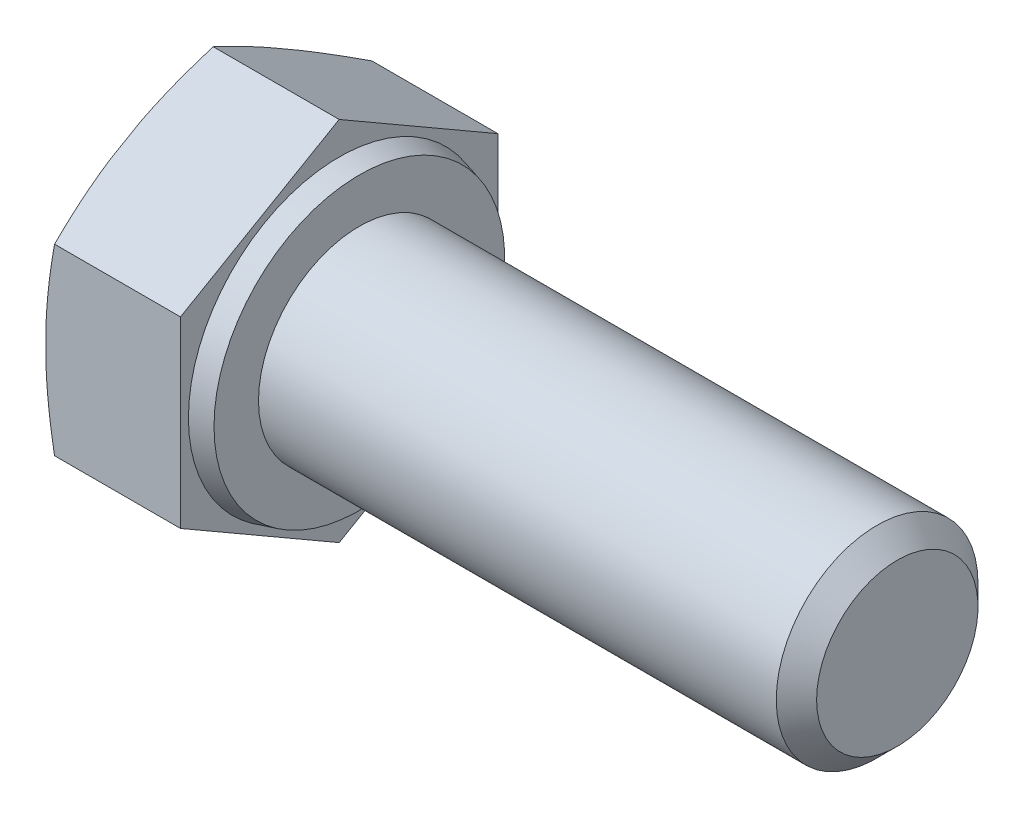
ISO-10303-21;
HEADER;
FILE_DESCRIPTION(('STEP AP214'),'2;1');
FILE_NAME('part.step','',(''),(''),'','','');
FILE_SCHEMA(('AUTOMOTIVE_DESIGN { 1 0 10303 214 1 1 1 1 }'));
ENDSEC;
DATA;
#1=APPLICATION_CONTEXT('core data for automotive mechanical design processes');
#2=APPLICATION_PROTOCOL_DEFINITION('international standard','automotive_design',2000,#1);
#3=PRODUCT_CONTEXT('',#1,'mechanical');
#4=PRODUCT('Part','Part','',(#3));
#5=PRODUCT_RELATED_PRODUCT_CATEGORY('part','',(#4));
#6=PRODUCT_DEFINITION_FORMATION('','',#4);
#7=PRODUCT_DEFINITION_CONTEXT('part definition',#1,'design');
#8=PRODUCT_DEFINITION('design','',#6,#7);
#9=PRODUCT_DEFINITION_SHAPE('','',#8);
#10=(LENGTH_UNIT() NAMED_UNIT(*) SI_UNIT(.MILLI.,.METRE.));
#11=(NAMED_UNIT(*) PLANE_ANGLE_UNIT() SI_UNIT($,.RADIAN.));
#12=(NAMED_UNIT(*) SI_UNIT($,.STERADIAN.) SOLID_ANGLE_UNIT());
#13=UNCERTAINTY_MEASURE_WITH_UNIT(LENGTH_MEASURE(1.E-05),#10,'distance_accuracy_value','');
#14=(GEOMETRIC_REPRESENTATION_CONTEXT(3) GLOBAL_UNCERTAINTY_ASSIGNED_CONTEXT((#13)) GLOBAL_UNIT_ASSIGNED_CONTEXT((#10,
#11,#12)) REPRESENTATION_CONTEXT('',''));
#15=CARTESIAN_POINT('',(0.,0.,0.));
#16=DIRECTION('',(0.,0.,1.));
#17=DIRECTION('',(1.,0.,0.));
#18=AXIS2_PLACEMENT_3D('',#15,#16,#17);
#19=CARTESIAN_POINT('',(16.5999999999999,-2.725,-4.71983845062519));
#20=DIRECTION('',(0.,-0.866025403784439,-0.5));
#21=DIRECTION('',(0.,0.5,-0.866025403784439));
#22=AXIS2_PLACEMENT_3D('',#19,#20,#21);
#23=PLANE('',#22);
#24=DIRECTION('',(-1.,0.,0.));
#25=VECTOR('',#24,1.);
#26=CARTESIAN_POINT('',(16.5999999999999,-5.45,0.));
#27=LINE('',#26,#25);
#28=CARTESIAN_POINT('',(0.,-5.45,0.));
#29=VERTEX_POINT('',#28);
#30=CARTESIAN_POINT('',(-3.7452208360137,-5.45,0.));
#31=VERTEX_POINT('',#30);
#32=EDGE_CURVE('E158',#29,#31,#27,.T.);
#33=ORIENTED_EDGE('',*,*,#32,.T.);
#34=CARTESIAN_POINT('',(-2.80359670741345,-7.34011268981057,3.27377121078258));
#35=CARTESIAN_POINT('',(-2.84436934173908,-7.27090787880275,3.15390496198883));
#36=CARTESIAN_POINT('',(-2.88473403740724,-7.2016429998134,3.03393467239918));
#37=CARTESIAN_POINT('',(-2.96451817766387,-7.06297557149015,2.79375564118839));
#38=CARTESIAN_POINT('',(-3.00393759976687,-6.9935730189238,2.6735468939685));
#39=CARTESIAN_POINT('',(-3.12060727053392,-6.78509054777123,2.31244466144474));
#40=CARTESIAN_POINT('',(-3.19624120176492,-6.64578254822507,2.07115612833001));
#41=CARTESIAN_POINT('',(-3.34254144823286,-6.36498483296062,1.58480021884271));
#42=CARTESIAN_POINT('',(-3.41314888153984,-6.22348739251692,1.33971946285328));
#43=CARTESIAN_POINT('',(-3.54653963124449,-5.93956996950973,0.847960061050806));
#44=CARTESIAN_POINT('',(-3.60932336119064,-5.79715003612673,0.601281500420866));
#45=CARTESIAN_POINT('',(-3.72240408986714,-5.51627771537165,0.114796370433285));
#46=CARTESIAN_POINT('',(-3.77306309614606,-5.37786233449134,-0.124946101800416));
#47=CARTESIAN_POINT('',(-3.86174791509955,-5.10000705673909,-0.606205560018476));
#48=CARTESIAN_POINT('',(-3.89977434383025,-4.9605672101666,-0.847722458881628));
#49=CARTESIAN_POINT('',(-3.96002895002584,-4.68152439808752,-1.33103878688949));
#50=CARTESIAN_POINT('',(-3.98233595362987,-4.54192581389901,-1.57283062736867));
#51=CARTESIAN_POINT('',(-4.00922217993067,-4.26230405370948,-2.05714972291879));
#52=CARTESIAN_POINT('',(-4.01380367654362,-4.12228093447653,-2.29967687966451));
#53=CARTESIAN_POINT('',(-4.00501625874682,-3.8508494021201,-2.76981008448214));
#54=CARTESIAN_POINT('',(-3.99271543484409,-3.71943177378256,-2.99743209377296));
#55=CARTESIAN_POINT('',(-3.95321166906913,-3.45715843275631,-3.45170284590126));
#56=CARTESIAN_POINT('',(-3.92600704652764,-3.32630278511853,-3.67835147606722));
#57=CARTESIAN_POINT('',(-3.85873771892874,-3.06480848650408,-4.13127288715704));
#58=CARTESIAN_POINT('',(-3.81861253999202,-2.93417381895763,-4.35753876857736));
#59=CARTESIAN_POINT('',(-3.72806412050347,-2.67381544243305,-4.80849270489409));
#60=CARTESIAN_POINT('',(-3.67764082013554,-2.54409173875073,-5.03318075061788));
#61=CARTESIAN_POINT('',(-3.56690934471619,-2.28103368100204,-5.48881067197899));
#62=CARTESIAN_POINT('',(-3.5063200098959,-2.14772928655015,-5.71970065604188));
#63=CARTESIAN_POINT('',(-3.37862490619735,-1.88190401874505,-6.18012352581591));
#64=CARTESIAN_POINT('',(-3.31151881066873,-1.74938318502113,-6.40965634288713));
#65=CARTESIAN_POINT('',(-3.17300072750933,-1.48622105229928,-6.86546652738956));
#66=CARTESIAN_POINT('',(-3.10163437183036,-1.35557371269241,-7.09175435746236));
#67=CARTESIAN_POINT('',(-2.99179561017672,-1.16001599812026,-7.43047025491337));
#68=CARTESIAN_POINT('',(-2.95472291342734,-1.09490757242993,-7.54324135620985));
#69=CARTESIAN_POINT('',(-2.87975227112319,-0.964810882473038,-7.76857543311172));
#70=CARTESIAN_POINT('',(-2.8418543411671,-0.899822615960361,-7.8811384126075));
#71=CARTESIAN_POINT('',(-2.80359670741345,-0.834887310189432,-7.99360966140777));
#72=B_SPLINE_CURVE_WITH_KNOTS('',3,(#34,#35,#36,#37,#38,#39,#40,#41,#42,#43,#44,#45,#46,#47,#48,
#49,#50,#51,#52,#53,#54,#55,#56,#57,#58,#59,#60,#61,#62,#63,#64,#65,#66,#67,#68,#69,#70,#71),
.UNSPECIFIED.,.F.,.F.,(4,2,2,2,2,2,2,2,2,2,2,2,2,2,2,2,2,2,4),(0.,0.432869091724628,
0.86574847002923,1.73179966816006,2.60673022630927,3.48161451738991,4.32567400721243,
5.16969232852602,6.00944755025397,6.84909504043365,7.6379988773398,8.42699169555014,
9.2197323731281,10.0124776554303,10.8325909601046,11.6527453939116,12.4653044284207,
12.871476359479,13.2776406196665),.UNSPECIFIED.);
#73=CARTESIAN_POINT('',(-4.,-4.35471947908043,-1.89708151077319));
#74=VERTEX_POINT('',#73);
#75=EDGE_CURVE('E203',#31,#74,#72,.T.);
#76=ORIENTED_EDGE('',*,*,#75,.T.);
#77=DIRECTION('',(0.,-0.5,0.866025403784439));
#78=VECTOR('',#77,1.);
#79=CARTESIAN_POINT('',(-4.,-2.725,-4.71983845062519));
#80=LINE('',#79,#78);
#81=CARTESIAN_POINT('',(-4.,-3.82028052091957,-2.822756939852));
#82=VERTEX_POINT('',#81);
#83=EDGE_CURVE('E213',#82,#74,#80,.T.);
#84=ORIENTED_EDGE('',*,*,#83,.F.);
#85=CARTESIAN_POINT('',(-3.7452208360137,-2.725,-4.71983845062519));
#86=VERTEX_POINT('',#85);
#87=EDGE_CURVE('E216',#82,#86,#72,.T.);
#88=ORIENTED_EDGE('',*,*,#87,.T.);
#89=DIRECTION('',(-1.,0.,0.));
#90=VECTOR('',#89,1.);
#91=CARTESIAN_POINT('',(16.5999999999999,-2.725,-4.71983845062519));
#92=LINE('',#91,#90);
#93=CARTESIAN_POINT('',(0.,-2.725,-4.71983845062519));
#94=VERTEX_POINT('',#93);
#95=EDGE_CURVE('E169',#94,#86,#92,.T.);
#96=ORIENTED_EDGE('',*,*,#95,.F.);
#97=DIRECTION('',(0.,-0.5,0.866025403784439));
#98=VECTOR('',#97,1.);
#99=CARTESIAN_POINT('',(0.,-2.725,-4.71983845062519));
#100=LINE('',#99,#98);
#101=EDGE_CURVE('E184',#94,#29,#100,.T.);
#102=ORIENTED_EDGE('',*,*,#101,.T.);
#103=EDGE_LOOP('',(#33,#76,#84,#88,#96,#102));
#104=FACE_BOUND('',#103,.T.);
#105=ADVANCED_FACE('F36',(#104),#23,.T.);
#106=CARTESIAN_POINT('',(16.5999999999999,2.725,-4.71983845062519));
#107=DIRECTION('',(0.,0.,-1.));
#108=DIRECTION('',(-1.,0.,0.));
#109=AXIS2_PLACEMENT_3D('',#106,#107,#108);
#110=PLANE('',#109);
#111=ORIENTED_EDGE('',*,*,#95,.T.);
#112=CARTESIAN_POINT('',(-2.9506871174777,-5.99877121078259,-4.71983845062519));
#113=CARTESIAN_POINT('',(-2.98850568066813,-5.86655061994932,-4.71983845062519));
#114=CARTESIAN_POINT('',(-3.02588733348672,-5.73420510572345,-4.71983845062519));
#115=CARTESIAN_POINT('',(-3.09964137777749,-5.46923092543767,-4.71983845062519));
#116=CARTESIAN_POINT('',(-3.13601375217484,-5.3366022546282,-4.71983845062519));
#117=CARTESIAN_POINT('',(-3.24344066732154,-4.93814152280156,-4.71983845062519));
#118=CARTESIAN_POINT('',(-3.31277438033119,-4.67184097821475,-4.71983845062519));
#119=CARTESIAN_POINT('',(-3.44598984723749,-4.13540056856217,-4.71983845062519));
#120=CARTESIAN_POINT('',(-3.50981875867931,-3.86524747724054,-4.71983845062519));
#121=CARTESIAN_POINT('',(-3.62935640937805,-3.3231474614196,-4.71983845062519));
#122=CARTESIAN_POINT('',(-3.68506574564966,-3.05120067034556,-4.71983845062519));
#123=CARTESIAN_POINT('',(-3.7842051067148,-2.51422588041989,-4.71983845062519));
#124=CARTESIAN_POINT('',(-3.82797675451138,-2.24926199844372,-4.71983845062519));
#125=CARTESIAN_POINT('',(-3.90294006806177,-1.71757094380412,-4.71983845062519));
#126=CARTESIAN_POINT('',(-3.93413417057669,-1.45084412287816,-4.71983845062519));
#127=CARTESIAN_POINT('',(-3.98136829922155,-0.917139045763637,-4.71983845062519));
#128=CARTESIAN_POINT('',(-3.99747120183632,-0.650166513848194,-4.71983845062519));
#129=CARTESIAN_POINT('',(-4.01319405607081,-0.115738248934143,-4.71983845062519));
#130=CARTESIAN_POINT('',(-4.01281531208384,0.151717444150779,-4.71983845062519));
#131=CARTESIAN_POINT('',(-3.99672210978996,0.652273398606605,-4.71983845062519));
#132=CARTESIAN_POINT('',(-3.98295365350144,0.885439786641174,-4.71983845062519));
#133=CARTESIAN_POINT('',(-3.9439102240837,1.35079228411295,-4.71983845062519));
#134=CARTESIAN_POINT('',(-3.91863474313828,1.58297834983112,-4.71983845062519));
#135=CARTESIAN_POINT('',(-3.8277233558607,2.27921679772146,-4.71983845062519));
#136=CARTESIAN_POINT('',(-3.74707511602764,2.74130964784515,-4.71983845062519));
#137=CARTESIAN_POINT('',(-3.60495532267596,3.43699496327634,-4.71983845062519));
#138=CARTESIAN_POINT('',(-3.55315057241573,3.67272543522797,-4.71983845062519));
#139=CARTESIAN_POINT('',(-3.44400801927864,4.14293122164741,-4.71983845062519));
#140=CARTESIAN_POINT('',(-3.38666994202673,4.37740647326489,-4.71983845062519));
#141=CARTESIAN_POINT('',(-3.26810191427154,4.84357463704433,-4.71983845062519));
#142=CARTESIAN_POINT('',(-3.20690265666811,5.07527546383244,-4.71983845062519));
#143=CARTESIAN_POINT('',(-3.08112090052241,5.53769892040991,-4.71983845062519));
#144=CARTESIAN_POINT('',(-3.01653922498027,5.76842177352407,-4.71983845062519));
#145=CARTESIAN_POINT('',(-2.95068711747769,5.99877121078259,-4.71983845062519));
#146=B_SPLINE_CURVE_WITH_KNOTS('',3,(#112,#113,#114,#115,#116,#117,#118,#119,#120,#121,#122,
#123,#124,#125,#126,#127,#128,#129,#130,#131,#132,#133,#134,#135,#136,#137,#138,#139,#140,#141,
#142,#143,#144,#145),.UNSPECIFIED.,.F.,.F.,(4,2,2,2,2,2,2,2,2,2,2,2,2,2,2,2,4),(0.,
0.41256707072817,0.825141116959283,1.65062085257202,2.48330240810143,3.31592270744702,
4.12134919611599,4.92661956719314,5.72851971870752,6.53035640621696,7.23076213486735,
7.93119877610125,9.33697768486694,10.0610249139554,10.7851080640487,11.5040240500474,
12.222765916872),.UNSPECIFIED.);
#147=CARTESIAN_POINT('',(-4.,-0.534438958160884,-4.71983845062518));
#148=VERTEX_POINT('',#147);
#149=EDGE_CURVE('E224',#86,#148,#146,.T.);
#150=ORIENTED_EDGE('',*,*,#149,.T.);
#151=DIRECTION('',(0.,-1.,0.));
#152=VECTOR('',#151,1.);
#153=CARTESIAN_POINT('',(-4.,2.725,-4.71983845062519));
#154=LINE('',#153,#152);
#155=CARTESIAN_POINT('',(-4.,0.534438958160885,-4.71983845062519));
#156=VERTEX_POINT('',#155);
#157=EDGE_CURVE('E164',#156,#148,#154,.T.);
#158=ORIENTED_EDGE('',*,*,#157,.F.);
#159=CARTESIAN_POINT('',(-3.7452208360137,2.725,-4.71983845062519));
#160=VERTEX_POINT('',#159);
#161=EDGE_CURVE('E51',#156,#160,#146,.T.);
#162=ORIENTED_EDGE('',*,*,#161,.T.);
#163=DIRECTION('',(-1.,0.,0.));
#164=VECTOR('',#163,1.);
#165=CARTESIAN_POINT('',(16.5999999999999,2.725,-4.71983845062519));
#166=LINE('',#165,#164);
#167=CARTESIAN_POINT('',(0.,2.725,-4.71983845062519));
#168=VERTEX_POINT('',#167);
#169=EDGE_CURVE('E155',#168,#160,#166,.T.);
#170=ORIENTED_EDGE('',*,*,#169,.F.);
#171=DIRECTION('',(0.,-1.,0.));
#172=VECTOR('',#171,1.);
#173=CARTESIAN_POINT('',(0.,5.45,-4.71983845062519));
#174=LINE('',#173,#172);
#175=EDGE_CURVE('E182',#168,#94,#174,.T.);
#176=ORIENTED_EDGE('',*,*,#175,.T.);
#177=EDGE_LOOP('',(#111,#150,#158,#162,#170,#176));
#178=FACE_BOUND('',#177,.T.);
#179=ADVANCED_FACE('F251',(#178),#110,.T.);
#180=CARTESIAN_POINT('',(16.5999999999999,5.45,0.));
#181=DIRECTION('',(0.,0.866025403784439,-0.5));
#182=DIRECTION('',(0.,0.5,0.866025403784439));
#183=AXIS2_PLACEMENT_3D('',#180,#181,#182);
#184=PLANE('',#183);
#185=ORIENTED_EDGE('',*,*,#169,.T.);
#186=CARTESIAN_POINT('',(-2.80359670741345,0.834887310189431,-7.99360966140777));
#187=CARTESIAN_POINT('',(-2.84436934173908,0.904092121197253,-7.87374341261402));
#188=CARTESIAN_POINT('',(-2.88473403740724,0.973357000186598,-7.75377312302437));
#189=CARTESIAN_POINT('',(-2.96451817766387,1.11202442850985,-7.51359409181358));
#190=CARTESIAN_POINT('',(-3.00393759976687,1.1814269810762,-7.3933853445937));
#191=CARTESIAN_POINT('',(-3.12060727053392,1.38990945222877,-7.03228311206994));
#192=CARTESIAN_POINT('',(-3.19624120176492,1.52921745177493,-6.7909945789552));
#193=CARTESIAN_POINT('',(-3.34254144823286,1.81001516703938,-6.3046386694679));
#194=CARTESIAN_POINT('',(-3.41314888153984,1.95151260748308,-6.05955791347847));
#195=CARTESIAN_POINT('',(-3.54653963124449,2.23543003049027,-5.567798511676));
#196=CARTESIAN_POINT('',(-3.60932336119064,2.37784996387327,-5.32111995104606));
#197=CARTESIAN_POINT('',(-3.72240408986713,2.65872228462835,-4.83463482105848));
#198=CARTESIAN_POINT('',(-3.77306309614606,2.79713766550867,-4.59489234882478));
#199=CARTESIAN_POINT('',(-3.86174791509955,3.07499294326092,-4.11363289060672));
#200=CARTESIAN_POINT('',(-3.89977434383025,3.2144327898334,-3.87211599174356));
#201=CARTESIAN_POINT('',(-3.96002895002584,3.49347560191248,-3.3887996637357));
#202=CARTESIAN_POINT('',(-3.98233595362987,3.63307418610099,-3.14700782325652));
#203=CARTESIAN_POINT('',(-4.00922217993067,3.91269594629053,-2.66268872770641));
#204=CARTESIAN_POINT('',(-4.01380367654362,4.05271906552347,-2.42016157096068));
#205=CARTESIAN_POINT('',(-4.00501625874682,4.3241505978799,-1.95002836614305));
#206=CARTESIAN_POINT('',(-3.99271543484409,4.45556822621744,-1.72240635685223));
#207=CARTESIAN_POINT('',(-3.95321166906913,4.71784156724369,-1.26813560472393));
#208=CARTESIAN_POINT('',(-3.92600704652764,4.84869721488147,-1.04148697455797));
#209=CARTESIAN_POINT('',(-3.85873771892874,5.11019151349592,-0.588565563468155));
#210=CARTESIAN_POINT('',(-3.81861253999202,5.24082618104237,-0.36229968204783));
#211=CARTESIAN_POINT('',(-3.72806412050348,5.50118455756696,0.0886542542689005));
#212=CARTESIAN_POINT('',(-3.67764082013554,5.63090826124928,0.313342299992688));
#213=CARTESIAN_POINT('',(-3.56690934471619,5.89396631899796,0.768972221353798));
#214=CARTESIAN_POINT('',(-3.5063200098959,6.02727071344986,0.999862205416685));
#215=CARTESIAN_POINT('',(-3.37862490619735,6.29309598125496,1.46028507519072));
#216=CARTESIAN_POINT('',(-3.31151881066873,6.42561681497888,1.68981789226193));
#217=CARTESIAN_POINT('',(-3.17300072750933,6.68877894770073,2.14562807676437));
#218=CARTESIAN_POINT('',(-3.10163437183036,6.81942628730759,2.37191590683717));
#219=CARTESIAN_POINT('',(-2.99179561017672,7.01498400187974,2.71063180428818));
#220=CARTESIAN_POINT('',(-2.95472291342734,7.08009242757007,2.82340290558466));
#221=CARTESIAN_POINT('',(-2.87975227112319,7.21018911752696,3.04873698248653));
#222=CARTESIAN_POINT('',(-2.8418543411671,7.27517738403964,3.16129996198231));
#223=CARTESIAN_POINT('',(-2.80359670741345,7.34011268981057,3.27377121078258));
#224=B_SPLINE_CURVE_WITH_KNOTS('',3,(#186,#187,#188,#189,#190,#191,#192,#193,#194,#195,#196,
#197,#198,#199,#200,#201,#202,#203,#204,#205,#206,#207,#208,#209,#210,#211,#212,#213,#214,#215,
#216,#217,#218,#219,#220,#221,#222,#223),.UNSPECIFIED.,.F.,.F.,(4,2,2,2,2,2,2,2,2,2,2,2,2,2,2,2,
2,2,4),(0.,0.432869091724627,0.865748470029229,1.73179966816006,2.60673022630927,
3.48161451738991,4.32567400721243,5.16969232852602,6.00944755025397,6.84909504043365,
7.6379988773398,8.42699169555014,9.21973237312809,10.0124776554303,10.8325909601046,
11.6527453939116,12.4653044284207,12.871476359479,13.2776406196665),.UNSPECIFIED.);
#225=CARTESIAN_POINT('',(-4.,3.82028052091956,-2.82275693985199));
#226=VERTEX_POINT('',#225);
#227=EDGE_CURVE('E246',#160,#226,#224,.T.);
#228=ORIENTED_EDGE('',*,*,#227,.T.);
#229=DIRECTION('',(0.,-0.5,-0.866025403784439));
#230=VECTOR('',#229,1.);
#231=CARTESIAN_POINT('',(-4.,5.45,0.));
#232=LINE('',#231,#230);
#233=CARTESIAN_POINT('',(-4.,4.35471947908044,-1.89708151077319));
#234=VERTEX_POINT('',#233);
#235=EDGE_CURVE('E236',#234,#226,#232,.T.);
#236=ORIENTED_EDGE('',*,*,#235,.F.);
#237=CARTESIAN_POINT('',(-3.7452208360137,5.45,0.));
#238=VERTEX_POINT('',#237);
#239=EDGE_CURVE('E59',#234,#238,#224,.T.);
#240=ORIENTED_EDGE('',*,*,#239,.T.);
#241=DIRECTION('',(-1.,0.,0.));
#242=VECTOR('',#241,1.);
#243=CARTESIAN_POINT('',(16.5999999999999,5.45,0.));
#244=LINE('',#243,#242);
#245=CARTESIAN_POINT('',(0.,5.45,0.));
#246=VERTEX_POINT('',#245);
#247=EDGE_CURVE('E152',#246,#238,#244,.T.);
#248=ORIENTED_EDGE('',*,*,#247,.F.);
#249=DIRECTION('',(0.,-0.5,-0.866025403784439));
#250=VECTOR('',#249,1.);
#251=CARTESIAN_POINT('',(0.,5.45,0.));
#252=LINE('',#251,#250);
#253=EDGE_CURVE('E180',#246,#168,#252,.T.);
#254=ORIENTED_EDGE('',*,*,#253,.T.);
#255=EDGE_LOOP('',(#185,#228,#236,#240,#248,#254));
#256=FACE_BOUND('',#255,.T.);
#257=ADVANCED_FACE('F244',(#256),#184,.T.);
#258=CARTESIAN_POINT('',(16.5999999999999,2.725,4.71983845062519));
#259=DIRECTION('',(0.,0.866025403784439,0.5));
#260=DIRECTION('',(0.,-0.5,0.866025403784439));
#261=AXIS2_PLACEMENT_3D('',#258,#259,#260);
#262=PLANE('',#261);
#263=ORIENTED_EDGE('',*,*,#247,.T.);
#264=CARTESIAN_POINT('',(-2.80359670741345,7.34011268981057,-3.27377121078259));
#265=CARTESIAN_POINT('',(-2.84436934173908,7.27090787880275,-3.15390496198884));
#266=CARTESIAN_POINT('',(-2.88473403740724,7.20164299981341,-3.03393467239918));
#267=CARTESIAN_POINT('',(-2.96451817766387,7.06297557149016,-2.7937556411884));
#268=CARTESIAN_POINT('',(-3.00393759976687,6.99357301892381,-2.67354689396851));
#269=CARTESIAN_POINT('',(-3.12060727053392,6.78509054777124,-2.31244466144475));
#270=CARTESIAN_POINT('',(-3.19624120176492,6.64578254822508,-2.07115612833002));
#271=CARTESIAN_POINT('',(-3.34254144823286,6.36498483296062,-1.58480021884272));
#272=CARTESIAN_POINT('',(-3.41314888153984,6.22348739251693,-1.33971946285329));
#273=CARTESIAN_POINT('',(-3.54653963124449,5.93956996950974,-0.847960061050813));
#274=CARTESIAN_POINT('',(-3.60932336119064,5.79715003612673,-0.601281500420872));
#275=CARTESIAN_POINT('',(-3.72240408986713,5.51627771537165,-0.114796370433292));
#276=CARTESIAN_POINT('',(-3.77306309614606,5.37786233449134,0.124946101800409));
#277=CARTESIAN_POINT('',(-3.86174791509955,5.10000705673909,0.60620556001847));
#278=CARTESIAN_POINT('',(-3.89977434383025,4.9605672101666,0.847722458881622));
#279=CARTESIAN_POINT('',(-3.96002895002584,4.68152439808752,1.33103878688948));
#280=CARTESIAN_POINT('',(-3.98233595362987,4.54192581389901,1.57283062736866));
#281=CARTESIAN_POINT('',(-4.00922217993067,4.26230405370948,2.05714972291878));
#282=CARTESIAN_POINT('',(-4.01380367654362,4.12228093447654,2.29967687966451));
#283=CARTESIAN_POINT('',(-4.00501625874682,3.8508494021201,2.76981008448214));
#284=CARTESIAN_POINT('',(-3.99271543484409,3.71943177378256,2.99743209377295));
#285=CARTESIAN_POINT('',(-3.95321166906913,3.45715843275631,3.45170284590126));
#286=CARTESIAN_POINT('',(-3.92600704652764,3.32630278511853,3.67835147606722));
#287=CARTESIAN_POINT('',(-3.85873771892874,3.06480848650408,4.13127288715704));
#288=CARTESIAN_POINT('',(-3.81861253999202,2.93417381895763,4.35753876857736));
#289=CARTESIAN_POINT('',(-3.72806412050347,2.67381544243304,4.80849270489409));
#290=CARTESIAN_POINT('',(-3.67764082013554,2.54409173875072,5.03318075061788));
#291=CARTESIAN_POINT('',(-3.56690934471619,2.28103368100204,5.48881067197899));
#292=CARTESIAN_POINT('',(-3.5063200098959,2.14772928655014,5.71970065604188));
#293=CARTESIAN_POINT('',(-3.37862490619735,1.88190401874504,6.18012352581592));
#294=CARTESIAN_POINT('',(-3.31151881066873,1.74938318502112,6.40965634288713));
#295=CARTESIAN_POINT('',(-3.17300072750933,1.48622105229927,6.86546652738957));
#296=CARTESIAN_POINT('',(-3.10163437183036,1.3555737126924,7.09175435746236));
#297=CARTESIAN_POINT('',(-2.99179561017671,1.16001599812025,7.43047025491338));
#298=CARTESIAN_POINT('',(-2.95472291342734,1.09490757242992,7.54324135620986));
#299=CARTESIAN_POINT('',(-2.87975227112319,0.964810882473031,7.76857543311173));
#300=CARTESIAN_POINT('',(-2.84185434116709,0.899822615960353,7.88113841260751));
#301=CARTESIAN_POINT('',(-2.80359670741345,0.834887310189424,7.99360966140778));
#302=B_SPLINE_CURVE_WITH_KNOTS('',3,(#264,#265,#266,#267,#268,#269,#270,#271,#272,#273,#274,
#275,#276,#277,#278,#279,#280,#281,#282,#283,#284,#285,#286,#287,#288,#289,#290,#291,#292,#293,
#294,#295,#296,#297,#298,#299,#300,#301),.UNSPECIFIED.,.F.,.F.,(4,2,2,2,2,2,2,2,2,2,2,2,2,2,2,2,
2,2,4),(0.,0.432869091724629,0.86574847002923,1.73179966816006,2.60673022630927,
3.48161451738992,4.32567400721243,5.16969232852603,6.00944755025398,6.84909504043365,
7.6379988773398,8.42699169555015,9.2197323731281,10.0124776554304,10.8325909601047,
11.6527453939117,12.4653044284208,12.871476359479,13.2776406196665),.UNSPECIFIED.);
#303=CARTESIAN_POINT('',(-4.,4.35471947908044,1.89708151077317));
#304=VERTEX_POINT('',#303);
#305=EDGE_CURVE('E146',#238,#304,#302,.T.);
#306=ORIENTED_EDGE('',*,*,#305,.T.);
#307=DIRECTION('',(0.,0.5,-0.866025403784439));
#308=VECTOR('',#307,1.);
#309=CARTESIAN_POINT('',(-4.,2.725,4.71983845062519));
#310=LINE('',#309,#308);
#311=CARTESIAN_POINT('',(-4.,3.82028052091955,2.82275693985201));
#312=VERTEX_POINT('',#311);
#313=EDGE_CURVE('E145',#312,#304,#310,.T.);
#314=ORIENTED_EDGE('',*,*,#313,.F.);
#315=CARTESIAN_POINT('',(-3.7452208360137,2.725,4.71983845062519));
#316=VERTEX_POINT('',#315);
#317=EDGE_CURVE('E127',#312,#316,#302,.T.);
#318=ORIENTED_EDGE('',*,*,#317,.T.);
#319=DIRECTION('',(-1.,0.,0.));
#320=VECTOR('',#319,1.);
#321=CARTESIAN_POINT('',(16.5999999999999,2.725,4.71983845062519));
#322=LINE('',#321,#320);
#323=CARTESIAN_POINT('',(0.,2.725,4.71983845062519));
#324=VERTEX_POINT('',#323);
#325=EDGE_CURVE('E141',#324,#316,#322,.T.);
#326=ORIENTED_EDGE('',*,*,#325,.F.);
#327=DIRECTION('',(0.,0.5,-0.866025403784439));
#328=VECTOR('',#327,1.);
#329=CARTESIAN_POINT('',(0.,5.45,0.));
#330=LINE('',#329,#328);
#331=EDGE_CURVE('E178',#324,#246,#330,.T.);
#332=ORIENTED_EDGE('',*,*,#331,.T.);
#333=EDGE_LOOP('',(#263,#306,#314,#318,#326,#332));
#334=FACE_BOUND('',#333,.T.);
#335=ADVANCED_FACE('F140',(#334),#262,.T.);
#336=CARTESIAN_POINT('',(16.5999999999999,-2.725,4.71983845062519));
#337=DIRECTION('',(0.,0.,1.));
#338=DIRECTION('',(1.,0.,0.));
#339=AXIS2_PLACEMENT_3D('',#336,#337,#338);
#340=PLANE('',#339);
#341=ORIENTED_EDGE('',*,*,#325,.T.);
#342=CARTESIAN_POINT('',(-2.9506871174777,5.99877121078258,4.71983845062519));
#343=CARTESIAN_POINT('',(-2.98850568066814,5.86655061994932,4.71983845062519));
#344=CARTESIAN_POINT('',(-3.02588733348672,5.73420510572344,4.71983845062519));
#345=CARTESIAN_POINT('',(-3.09964137777749,5.46923092543767,4.71983845062519));
#346=CARTESIAN_POINT('',(-3.13601375217484,5.33660225462819,4.71983845062519));
#347=CARTESIAN_POINT('',(-3.24344066732154,4.93814152280155,4.71983845062519));
#348=CARTESIAN_POINT('',(-3.31277438033119,4.67184097821474,4.71983845062519));
#349=CARTESIAN_POINT('',(-3.44598984723749,4.13540056856216,4.71983845062519));
#350=CARTESIAN_POINT('',(-3.50981875867931,3.86524747724053,4.71983845062519));
#351=CARTESIAN_POINT('',(-3.62935640937805,3.32314746141959,4.71983845062519));
#352=CARTESIAN_POINT('',(-3.68506574564967,3.05120067034555,4.71983845062519));
#353=CARTESIAN_POINT('',(-3.7842051067148,2.51422588041988,4.71983845062519));
#354=CARTESIAN_POINT('',(-3.82797675451138,2.24926199844371,4.71983845062519));
#355=CARTESIAN_POINT('',(-3.90294006806177,1.71757094380412,4.71983845062519));
#356=CARTESIAN_POINT('',(-3.93413417057669,1.45084412287815,4.71983845062519));
#357=CARTESIAN_POINT('',(-3.98136829922155,0.917139045763629,4.71983845062519));
#358=CARTESIAN_POINT('',(-3.99747120183632,0.650166513848186,4.71983845062519));
#359=CARTESIAN_POINT('',(-4.01319405607081,0.115738248934136,4.71983845062519));
#360=CARTESIAN_POINT('',(-4.01281531208384,-0.151717444150786,4.71983845062519));
#361=CARTESIAN_POINT('',(-3.99672210978996,-0.652273398606611,4.71983845062519));
#362=CARTESIAN_POINT('',(-3.98295365350144,-0.885439786641179,4.71983845062519));
#363=CARTESIAN_POINT('',(-3.9439102240837,-1.35079228411295,4.71983845062519));
#364=CARTESIAN_POINT('',(-3.91863474313828,-1.58297834983112,4.71983845062519));
#365=CARTESIAN_POINT('',(-3.8277233558607,-2.27921679772146,4.71983845062519));
#366=CARTESIAN_POINT('',(-3.74707511602764,-2.74130964784515,4.71983845062519));
#367=CARTESIAN_POINT('',(-3.60495532267596,-3.43699496327634,4.71983845062519));
#368=CARTESIAN_POINT('',(-3.55315057241573,-3.67272543522797,4.71983845062519));
#369=CARTESIAN_POINT('',(-3.44400801927864,-4.14293122164741,4.71983845062519));
#370=CARTESIAN_POINT('',(-3.38666994202673,-4.37740647326488,4.71983845062519));
#371=CARTESIAN_POINT('',(-3.26810191427154,-4.84357463704433,4.71983845062519));
#372=CARTESIAN_POINT('',(-3.20690265666811,-5.07527546383243,4.71983845062519));
#373=CARTESIAN_POINT('',(-3.08112090052241,-5.5376989204099,4.71983845062519));
#374=CARTESIAN_POINT('',(-3.01653922498027,-5.76842177352407,4.71983845062519));
#375=CARTESIAN_POINT('',(-2.9506871174777,-5.99877121078258,4.71983845062519));
#376=B_SPLINE_CURVE_WITH_KNOTS('',3,(#342,#343,#344,#345,#346,#347,#348,#349,#350,#351,#352,
#353,#354,#355,#356,#357,#358,#359,#360,#361,#362,#363,#364,#365,#366,#367,#368,#369,#370,#371,
#372,#373,#374,#375),.UNSPECIFIED.,.F.,.F.,(4,2,2,2,2,2,2,2,2,2,2,2,2,2,2,2,4),(0.,
0.412567070728169,0.825141116959283,1.65062085257202,2.48330240810142,3.31592270744702,
4.12134919611599,4.92661956719314,5.72851971870752,6.53035640621696,7.23076213486734,
7.93119877610124,9.33697768486693,10.0610249139553,10.7851080640486,11.5040240500474,
12.222765916872),.UNSPECIFIED.);
#377=CARTESIAN_POINT('',(-4.,0.534438958160869,4.71983845062518));
#378=VERTEX_POINT('',#377);
#379=EDGE_CURVE('E124',#316,#378,#376,.T.);
#380=ORIENTED_EDGE('',*,*,#379,.T.);
#381=DIRECTION('',(0.,1.,0.));
#382=VECTOR('',#381,1.);
#383=CARTESIAN_POINT('',(-4.,-2.725,4.71983845062519));
#384=LINE('',#383,#382);
#385=CARTESIAN_POINT('',(-4.,-0.53443895816087,4.71983845062519));
#386=VERTEX_POINT('',#385);
#387=EDGE_CURVE('E222',#386,#378,#384,.T.);
#388=ORIENTED_EDGE('',*,*,#387,.F.);
#389=CARTESIAN_POINT('',(-3.7452208360137,-2.725,4.71983845062519));
#390=VERTEX_POINT('',#389);
#391=EDGE_CURVE('E134',#386,#390,#376,.T.);
#392=ORIENTED_EDGE('',*,*,#391,.T.);
#393=DIRECTION('',(-1.,0.,0.));
#394=VECTOR('',#393,1.);
#395=CARTESIAN_POINT('',(16.5999999999999,-2.725,4.71983845062519));
#396=LINE('',#395,#394);
#397=CARTESIAN_POINT('',(0.,-2.725,4.71983845062519));
#398=VERTEX_POINT('',#397);
#399=EDGE_CURVE('E153',#398,#390,#396,.T.);
#400=ORIENTED_EDGE('',*,*,#399,.F.);
#401=DIRECTION('',(0.,1.,0.));
#402=VECTOR('',#401,1.);
#403=CARTESIAN_POINT('',(0.,5.45,4.71983845062519));
#404=LINE('',#403,#402);
#405=EDGE_CURVE('E151',#398,#324,#404,.T.);
#406=ORIENTED_EDGE('',*,*,#405,.T.);
#407=EDGE_LOOP('',(#341,#380,#388,#392,#400,#406));
#408=FACE_BOUND('',#407,.T.);
#409=ADVANCED_FACE('F148',(#408),#340,.T.);
#410=CARTESIAN_POINT('',(16.5999999999999,-5.45,0.));
#411=DIRECTION('',(0.,-0.866025403784439,0.5));
#412=DIRECTION('',(0.,-0.5,-0.866025403784439));
#413=AXIS2_PLACEMENT_3D('',#410,#411,#412);
#414=PLANE('',#413);
#415=ORIENTED_EDGE('',*,*,#399,.T.);
#416=CARTESIAN_POINT('',(-2.80359670741345,-0.834887310189426,7.99360966140778));
#417=CARTESIAN_POINT('',(-2.84436934173908,-0.904092121197248,7.87374341261403));
#418=CARTESIAN_POINT('',(-2.88473403740724,-0.973357000186593,7.75377312302437));
#419=CARTESIAN_POINT('',(-2.96451817766387,-1.11202442850984,7.51359409181359));
#420=CARTESIAN_POINT('',(-3.00393759976687,-1.18142698107619,7.3933853445937));
#421=CARTESIAN_POINT('',(-3.12060727053392,-1.38990945222876,7.03228311206994));
#422=CARTESIAN_POINT('',(-3.19624120176492,-1.52921745177492,6.79099457895521));
#423=CARTESIAN_POINT('',(-3.34254144823286,-1.81001516703938,6.30463866946791));
#424=CARTESIAN_POINT('',(-3.41314888153984,-1.95151260748307,6.05955791347848));
#425=CARTESIAN_POINT('',(-3.54653963124449,-2.23543003049026,5.567798511676));
#426=CARTESIAN_POINT('',(-3.60932336119064,-2.37784996387327,5.32111995104606));
#427=CARTESIAN_POINT('',(-3.72240408986713,-2.65872228462835,4.83463482105848));
#428=CARTESIAN_POINT('',(-3.77306309614606,-2.79713766550866,4.59489234882478));
#429=CARTESIAN_POINT('',(-3.86174791509955,-3.07499294326091,4.11363289060672));
#430=CARTESIAN_POINT('',(-3.89977434383025,-3.2144327898334,3.87211599174356));
#431=CARTESIAN_POINT('',(-3.96002895002584,-3.49347560191248,3.3887996637357));
#432=CARTESIAN_POINT('',(-3.98233595362987,-3.63307418610099,3.14700782325652));
#433=CARTESIAN_POINT('',(-4.00922217993067,-3.91269594629052,2.66268872770641));
#434=CARTESIAN_POINT('',(-4.01380367654362,-4.05271906552346,2.42016157096068));
#435=CARTESIAN_POINT('',(-4.00501625874682,-4.3241505978799,1.95002836614305));
#436=CARTESIAN_POINT('',(-3.99271543484409,-4.45556822621744,1.72240635685223));
#437=CARTESIAN_POINT('',(-3.95321166906913,-4.71784156724369,1.26813560472393));
#438=CARTESIAN_POINT('',(-3.92600704652764,-4.84869721488147,1.04148697455797));
#439=CARTESIAN_POINT('',(-3.85873771892874,-5.11019151349592,0.588565563468153));
#440=CARTESIAN_POINT('',(-3.81861253999202,-5.24082618104237,0.362299682047829));
#441=CARTESIAN_POINT('',(-3.72806412050348,-5.50118455756696,-0.0886542542689027));
#442=CARTESIAN_POINT('',(-3.67764082013554,-5.63090826124928,-0.313342299992691));
#443=CARTESIAN_POINT('',(-3.56690934471619,-5.89396631899796,-0.768972221353801));
#444=CARTESIAN_POINT('',(-3.5063200098959,-6.02727071344986,-0.999862205416688));
#445=CARTESIAN_POINT('',(-3.37862490619735,-6.29309598125496,-1.46028507519072));
#446=CARTESIAN_POINT('',(-3.31151881066873,-6.42561681497888,-1.68981789226194));
#447=CARTESIAN_POINT('',(-3.17300072750933,-6.68877894770073,-2.14562807676437));
#448=CARTESIAN_POINT('',(-3.10163437183036,-6.8194262873076,-2.37191590683717));
#449=CARTESIAN_POINT('',(-2.99179561017672,-7.01498400187974,-2.71063180428819));
#450=CARTESIAN_POINT('',(-2.95472291342734,-7.08009242757008,-2.82340290558466));
#451=CARTESIAN_POINT('',(-2.87975227112319,-7.21018911752697,-3.04873698248653));
#452=CARTESIAN_POINT('',(-2.8418543411671,-7.27517738403964,-3.16129996198232));
#453=CARTESIAN_POINT('',(-2.80359670741345,-7.34011268981057,-3.27377121078259));
#454=B_SPLINE_CURVE_WITH_KNOTS('',3,(#416,#417,#418,#419,#420,#421,#422,#423,#424,#425,#426,
#427,#428,#429,#430,#431,#432,#433,#434,#435,#436,#437,#438,#439,#440,#441,#442,#443,#444,#445,
#446,#447,#448,#449,#450,#451,#452,#453),.UNSPECIFIED.,.F.,.F.,(4,2,2,2,2,2,2,2,2,2,2,2,2,2,2,2,
2,2,4),(0.,0.432869091724629,0.865748470029231,1.73179966816007,2.60673022630927,
3.48161451738992,4.32567400721243,5.16969232852603,6.00944755025398,6.84909504043365,
7.6379988773398,8.42699169555015,9.2197323731281,10.0124776554303,10.8325909601046,
11.6527453939117,12.4653044284208,12.871476359479,13.2776406196665),.UNSPECIFIED.);
#455=CARTESIAN_POINT('',(-4.,-3.82028052091955,2.822756939852));
#456=VERTEX_POINT('',#455);
#457=EDGE_CURVE('E214',#390,#456,#454,.T.);
#458=ORIENTED_EDGE('',*,*,#457,.T.);
#459=DIRECTION('',(0.,0.5,0.866025403784439));
#460=VECTOR('',#459,1.);
#461=CARTESIAN_POINT('',(-4.,-5.45,0.));
#462=LINE('',#461,#460);
#463=CARTESIAN_POINT('',(-4.,-4.35471947908044,1.89708151077319));
#464=VERTEX_POINT('',#463);
#465=EDGE_CURVE('E220',#464,#456,#462,.T.);
#466=ORIENTED_EDGE('',*,*,#465,.F.);
#467=EDGE_CURVE('E205',#464,#31,#454,.T.);
#468=ORIENTED_EDGE('',*,*,#467,.T.);
#469=ORIENTED_EDGE('',*,*,#32,.F.);
#470=DIRECTION('',(0.,0.5,0.866025403784439));
#471=VECTOR('',#470,1.);
#472=CARTESIAN_POINT('',(0.,-2.725,4.71983845062519));
#473=LINE('',#472,#471);
#474=EDGE_CURVE('E175',#29,#398,#473,.T.);
#475=ORIENTED_EDGE('',*,*,#474,.T.);
#476=EDGE_LOOP('',(#415,#458,#466,#468,#469,#475));
#477=FACE_BOUND('',#476,.T.);
#478=ADVANCED_FACE('F272',(#477),#414,.T.);
#479=CARTESIAN_POINT('',(-4.,0.,0.));
#480=DIRECTION('',(1.,0.,0.));
#481=DIRECTION('',(0.,0.,-1.));
#482=AXIS2_PLACEMENT_3D('',#479,#480,#481);
#483=PLANE('',#482);
#484=CARTESIAN_POINT('',(-4.,0.,0.));
#485=DIRECTION('',(1.,0.,0.));
#486=DIRECTION('',(0.,0.,-1.));
#487=AXIS2_PLACEMENT_3D('',#484,#485,#486);
#488=CIRCLE('',#487,4.75000000000001);
#489=EDGE_CURVE('E189',#156,#226,#488,.T.);
#490=ORIENTED_EDGE('',*,*,#489,.F.);
#491=ORIENTED_EDGE('',*,*,#157,.T.);
#492=EDGE_CURVE('E187',#82,#148,#488,.T.);
#493=ORIENTED_EDGE('',*,*,#492,.F.);
#494=ORIENTED_EDGE('',*,*,#83,.T.);
#495=EDGE_CURVE('E188',#464,#74,#488,.T.);
#496=ORIENTED_EDGE('',*,*,#495,.F.);
#497=ORIENTED_EDGE('',*,*,#465,.T.);
#498=EDGE_CURVE('E195',#386,#456,#488,.T.);
#499=ORIENTED_EDGE('',*,*,#498,.F.);
#500=ORIENTED_EDGE('',*,*,#387,.T.);
#501=CARTESIAN_POINT('',(-4.,0.,0.));
#502=DIRECTION('',(-1.,0.,0.));
#503=DIRECTION('',(0.,0.,1.));
#504=AXIS2_PLACEMENT_3D('',#501,#502,#503);
#505=CIRCLE('',#504,4.75);
#506=EDGE_CURVE('E129',#378,#312,#505,.T.);
#507=ORIENTED_EDGE('',*,*,#506,.T.);
#508=ORIENTED_EDGE('',*,*,#313,.T.);
#509=EDGE_CURVE('E193',#234,#304,#488,.T.);
#510=ORIENTED_EDGE('',*,*,#509,.F.);
#511=ORIENTED_EDGE('',*,*,#235,.T.);
#512=EDGE_LOOP('',(#490,#491,#493,#494,#496,#497,#499,#500,#507,#508,#510,#511));
#513=FACE_BOUND('',#512,.T.);
#514=ADVANCED_FACE('F218',(#513),#483,.F.);
#515=CARTESIAN_POINT('',(0.,5.45,0.));
#516=DIRECTION('',(-1.,0.,0.));
#517=DIRECTION('',(0.,0.,1.));
#518=AXIS2_PLACEMENT_3D('',#515,#516,#517);
#519=PLANE('',#518);
#520=CARTESIAN_POINT('',(0.,0.,0.));
#521=DIRECTION('',(-1.,0.,0.));
#522=DIRECTION('',(0.,0.,1.));
#523=AXIS2_PLACEMENT_3D('',#520,#521,#522);
#524=CIRCLE('',#523,4.48397459621555);
#525=CARTESIAN_POINT('',(0.,0.,4.48397459621555));
#526=VERTEX_POINT('',#525);
#527=EDGE_CURVE('E172',#526,#526,#524,.T.);
#528=ORIENTED_EDGE('',*,*,#527,.T.);
#529=EDGE_LOOP('',(#528));
#530=FACE_BOUND('',#529,.T.);
#531=ORIENTED_EDGE('',*,*,#101,.F.);
#532=ORIENTED_EDGE('',*,*,#175,.F.);
#533=ORIENTED_EDGE('',*,*,#253,.F.);
#534=ORIENTED_EDGE('',*,*,#331,.F.);
#535=ORIENTED_EDGE('',*,*,#405,.F.);
#536=ORIENTED_EDGE('',*,*,#474,.F.);
#537=EDGE_LOOP('',(#531,#532,#533,#534,#535,#536));
#538=FACE_BOUND('',#537,.T.);
#539=ADVANCED_FACE('F256',(#530,#538),#519,.F.);
#540=CARTESIAN_POINT('',(0.599999999999934,0.,0.));
#541=DIRECTION('',(-1.,0.,0.));
#542=DIRECTION('',(0.,0.,1.));
#543=AXIS2_PLACEMENT_3D('',#540,#541,#542);
#544=CONICAL_SURFACE('',#543,4.32320508075687,0.261799387799173);
#545=ORIENTED_EDGE('',*,*,#527,.F.);
#546=EDGE_LOOP('',(#545));
#547=FACE_BOUND('',#546,.T.);
#548=CARTESIAN_POINT('',(0.599999999999934,0.,0.));
#549=DIRECTION('',(-1.,0.,0.));
#550=DIRECTION('',(0.,0.,1.));
#551=AXIS2_PLACEMENT_3D('',#548,#549,#550);
#552=CIRCLE('',#551,4.32320508075687);
#553=CARTESIAN_POINT('',(0.599999999999934,0.,4.32320508075687));
#554=VERTEX_POINT('',#553);
#555=EDGE_CURVE('E168',#554,#554,#552,.T.);
#556=ORIENTED_EDGE('',*,*,#555,.T.);
#557=EDGE_LOOP('',(#556));
#558=FACE_BOUND('',#557,.T.);
#559=ADVANCED_FACE('F325',(#547,#558),#544,.T.);
#560=CARTESIAN_POINT('',(0.600000000000001,4.32320508075687,0.));
#561=DIRECTION('',(-1.,0.,0.));
#562=DIRECTION('',(0.,0.,1.));
#563=AXIS2_PLACEMENT_3D('',#560,#561,#562);
#564=PLANE('',#563);
#565=ORIENTED_EDGE('',*,*,#555,.F.);
#566=EDGE_LOOP('',(#565));
#567=FACE_BOUND('',#566,.T.);
#568=CARTESIAN_POINT('',(0.599999999999934,0.,0.));
#569=DIRECTION('',(-1.,0.,0.));
#570=DIRECTION('',(0.,0.,1.));
#571=AXIS2_PLACEMENT_3D('',#568,#569,#570);
#572=CIRCLE('',#571,3.);
#573=CARTESIAN_POINT('',(0.599999999999934,0.,3.));
#574=VERTEX_POINT('',#573);
#575=EDGE_CURVE('E165',#574,#574,#572,.T.);
#576=ORIENTED_EDGE('',*,*,#575,.T.);
#577=EDGE_LOOP('',(#576));
#578=FACE_BOUND('',#577,.T.);
#579=ADVANCED_FACE('F322',(#567,#578),#564,.F.);
#580=CARTESIAN_POINT('',(-1000.,0.,0.));
#581=DIRECTION('',(-1.,0.,0.));
#582=DIRECTION('',(0.,0.,1.));
#583=AXIS2_PLACEMENT_3D('',#580,#581,#582);
#584=CYLINDRICAL_SURFACE('',#583,3.);
#585=CARTESIAN_POINT('',(16.,0.,0.));
#586=DIRECTION('',(-1.,0.,0.));
#587=DIRECTION('',(0.,0.,1.));
#588=AXIS2_PLACEMENT_3D('',#585,#586,#587);
#589=CIRCLE('',#588,3.);
#590=CARTESIAN_POINT('',(16.,0.,3.));
#591=VERTEX_POINT('',#590);
#592=EDGE_CURVE('E44',#591,#591,#589,.T.);
#593=ORIENTED_EDGE('',*,*,#592,.T.);
#594=EDGE_LOOP('',(#593));
#595=FACE_BOUND('',#594,.T.);
#596=ORIENTED_EDGE('',*,*,#575,.F.);
#597=EDGE_LOOP('',(#596));
#598=FACE_BOUND('',#597,.T.);
#599=ADVANCED_FACE('F318',(#595,#598),#584,.T.);
#600=CARTESIAN_POINT('',(16.6,3.,0.));
#601=DIRECTION('',(-1.,0.,0.));
#602=DIRECTION('',(0.,0.,1.));
#603=AXIS2_PLACEMENT_3D('',#600,#601,#602);
#604=PLANE('',#603);
#605=CARTESIAN_POINT('',(16.6,0.,0.));
#606=DIRECTION('',(-1.,0.,0.));
#607=DIRECTION('',(0.,0.,1.));
#608=AXIS2_PLACEMENT_3D('',#605,#606,#607);
#609=CIRCLE('',#608,2.39999999999985);
#610=CARTESIAN_POINT('',(16.6,0.,2.39999999999985));
#611=VERTEX_POINT('',#610);
#612=EDGE_CURVE('E12',#611,#611,#609,.F.);
#613=ORIENTED_EDGE('',*,*,#612,.T.);
#614=EDGE_LOOP('',(#613));
#615=FACE_BOUND('',#614,.T.);
#616=ADVANCED_FACE('F315',(#615),#604,.F.);
#617=CARTESIAN_POINT('',(-4.,0.,0.));
#618=DIRECTION('',(1.,0.,0.));
#619=DIRECTION('',(0.,0.,-1.));
#620=AXIS2_PLACEMENT_3D('',#617,#618,#619);
#621=CONICAL_SURFACE('',#620,4.75,1.22173047639607);
#622=ORIENTED_EDGE('',*,*,#492,.T.);
#623=ORIENTED_EDGE('',*,*,#149,.F.);
#624=ORIENTED_EDGE('',*,*,#87,.F.);
#625=EDGE_LOOP('',(#622,#623,#624));
#626=FACE_BOUND('',#625,.T.);
#627=ADVANCED_FACE('F278',(#626),#621,.T.);
#628=ORIENTED_EDGE('',*,*,#467,.F.);
#629=ORIENTED_EDGE('',*,*,#495,.T.);
#630=ORIENTED_EDGE('',*,*,#75,.F.);
#631=EDGE_LOOP('',(#628,#629,#630));
#632=FACE_BOUND('',#631,.T.);
#633=ADVANCED_FACE('F202',(#632),#621,.T.);
#634=ORIENTED_EDGE('',*,*,#498,.T.);
#635=ORIENTED_EDGE('',*,*,#457,.F.);
#636=ORIENTED_EDGE('',*,*,#391,.F.);
#637=EDGE_LOOP('',(#634,#635,#636));
#638=FACE_BOUND('',#637,.T.);
#639=ADVANCED_FACE('F277',(#638),#621,.T.);
#640=ORIENTED_EDGE('',*,*,#506,.F.);
#641=ORIENTED_EDGE('',*,*,#379,.F.);
#642=ORIENTED_EDGE('',*,*,#317,.F.);
#643=EDGE_LOOP('',(#640,#641,#642));
#644=FACE_BOUND('',#643,.T.);
#645=ADVANCED_FACE('F126',(#644),#621,.T.);
#646=ORIENTED_EDGE('',*,*,#509,.T.);
#647=ORIENTED_EDGE('',*,*,#305,.F.);
#648=ORIENTED_EDGE('',*,*,#239,.F.);
#649=EDGE_LOOP('',(#646,#647,#648));
#650=FACE_BOUND('',#649,.T.);
#651=ADVANCED_FACE('F380',(#650),#621,.T.);
#652=ORIENTED_EDGE('',*,*,#489,.T.);
#653=ORIENTED_EDGE('',*,*,#227,.F.);
#654=ORIENTED_EDGE('',*,*,#161,.F.);
#655=EDGE_LOOP('',(#652,#653,#654));
#656=FACE_BOUND('',#655,.T.);
#657=ADVANCED_FACE('F364',(#656),#621,.T.);
#658=CARTESIAN_POINT('',(16.,0.,0.));
#659=DIRECTION('',(-1.,0.,0.));
#660=DIRECTION('',(0.,0.,1.));
#661=AXIS2_PLACEMENT_3D('',#658,#659,#660);
#662=CONICAL_SURFACE('',#661,3.,0.785398163397582);
#663=ORIENTED_EDGE('',*,*,#612,.F.);
#664=EDGE_LOOP('',(#663));
#665=FACE_BOUND('',#664,.T.);
#666=ORIENTED_EDGE('',*,*,#592,.F.);
#667=EDGE_LOOP('',(#666));
#668=FACE_BOUND('',#667,.T.);
#669=ADVANCED_FACE('F38',(#665,#668),#662,.T.);
#670=CLOSED_SHELL('',(#105,#179,#257,#335,#409,#478,#514,#539,#559,#579,#599,#616,#627,#633,
#639,#645,#651,#657,#669));
#671=MANIFOLD_SOLID_BREP('B2',#670);
#672=ADVANCED_BREP_SHAPE_REPRESENTATION('',(#18,#671),#14);
#673=SHAPE_DEFINITION_REPRESENTATION(#9,#672);
ENDSEC;
END-ISO-10303-21;
